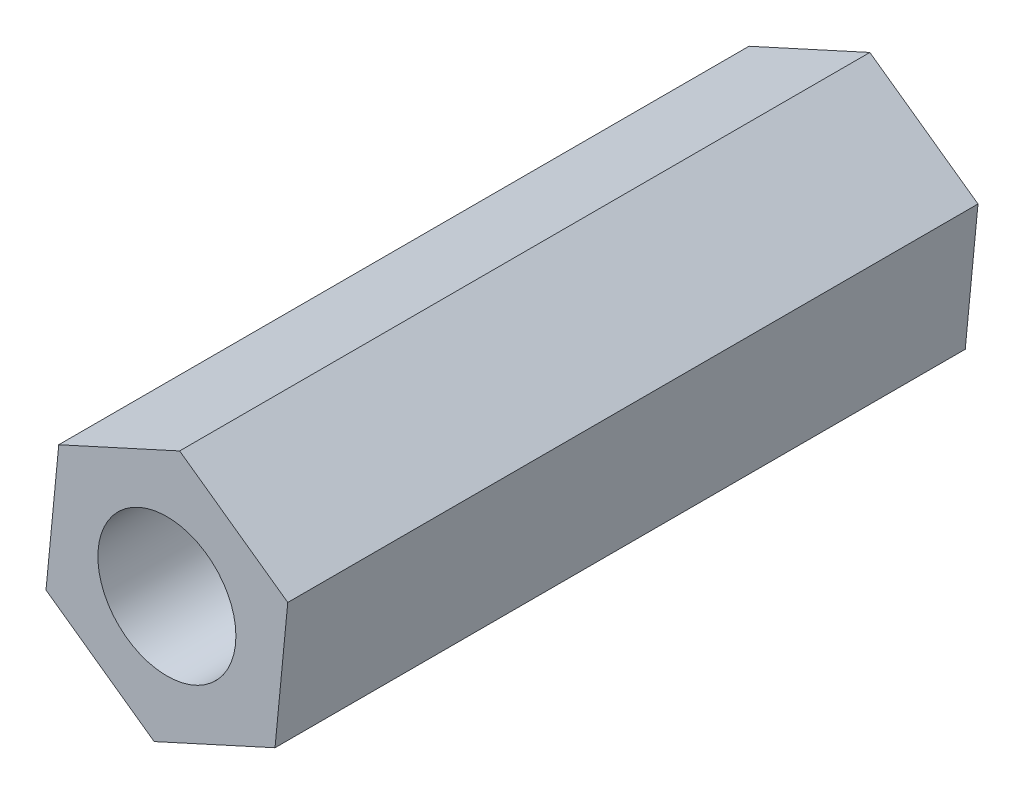
ISO-10303-21;
HEADER;
FILE_DESCRIPTION(('STEP AP214'),'2;1');
FILE_NAME('part.step','',(''),(''),'','','');
FILE_SCHEMA(('AUTOMOTIVE_DESIGN { 1 0 10303 214 1 1 1 1 }'));
ENDSEC;
DATA;
#1=APPLICATION_CONTEXT('core data for automotive mechanical design processes');
#2=APPLICATION_PROTOCOL_DEFINITION('international standard','automotive_design',2000,#1);
#3=PRODUCT_CONTEXT('',#1,'mechanical');
#4=PRODUCT('Part','Part','',(#3));
#5=PRODUCT_RELATED_PRODUCT_CATEGORY('part','',(#4));
#6=PRODUCT_DEFINITION_FORMATION('','',#4);
#7=PRODUCT_DEFINITION_CONTEXT('part definition',#1,'design');
#8=PRODUCT_DEFINITION('design','',#6,#7);
#9=PRODUCT_DEFINITION_SHAPE('','',#8);
#10=(LENGTH_UNIT() NAMED_UNIT(*) SI_UNIT(.MILLI.,.METRE.));
#11=(NAMED_UNIT(*) PLANE_ANGLE_UNIT() SI_UNIT($,.RADIAN.));
#12=(NAMED_UNIT(*) SI_UNIT($,.STERADIAN.) SOLID_ANGLE_UNIT());
#13=UNCERTAINTY_MEASURE_WITH_UNIT(LENGTH_MEASURE(1.E-05),#10,'distance_accuracy_value','');
#14=(GEOMETRIC_REPRESENTATION_CONTEXT(3) GLOBAL_UNCERTAINTY_ASSIGNED_CONTEXT((#13)) GLOBAL_UNIT_ASSIGNED_CONTEXT((#10,
#11,#12)) REPRESENTATION_CONTEXT('',''));
#15=CARTESIAN_POINT('',(0.,0.,0.));
#16=DIRECTION('',(0.,0.,1.));
#17=DIRECTION('',(1.,0.,0.));
#18=AXIS2_PLACEMENT_3D('',#15,#16,#17);
#19=CARTESIAN_POINT('',(0.,0.,15.));
#20=DIRECTION('',(0.,0.,1.));
#21=DIRECTION('',(1.,0.,0.));
#22=AXIS2_PLACEMENT_3D('',#19,#20,#21);
#23=PLANE('',#22);
#24=DIRECTION('',(0.0959864545210911,0.995382640268792,0.));
#25=VECTOR('',#24,1.);
#26=CARTESIAN_POINT('',(2.34991208728121,-1.6766772245674,15.));
#27=LINE('',#26,#25);
#28=CARTESIAN_POINT('',(2.34991208728121,-1.6766772245674,15.));
#29=VERTEX_POINT('',#28);
#30=CARTESIAN_POINT('',(2.62700111406275,1.19674495196194,15.));
#31=VERTEX_POINT('',#30);
#32=EDGE_CURVE('E128',#29,#31,#27,.T.);
#33=ORIENTED_EDGE('',*,*,#32,.T.);
#34=DIRECTION('',(-0.814033425698255,0.58081802816886,0.));
#35=VECTOR('',#34,1.);
#36=CARTESIAN_POINT('',(2.62700111406275,1.19674495196194,15.));
#37=LINE('',#36,#35);
#38=CARTESIAN_POINT('',(0.277089026781549,2.87342217652934,15.));
#39=VERTEX_POINT('',#38);
#40=EDGE_CURVE('E86',#31,#39,#37,.T.);
#41=ORIENTED_EDGE('',*,*,#40,.T.);
#42=DIRECTION('',(-0.910019880219347,-0.414564612099931,0.));
#43=VECTOR('',#42,1.);
#44=CARTESIAN_POINT('',(0.277089026781549,2.87342217652934,15.));
#45=LINE('',#44,#43);
#46=CARTESIAN_POINT('',(-2.3499120872812,1.6766772245674,15.));
#47=VERTEX_POINT('',#46);
#48=EDGE_CURVE('E99',#39,#47,#45,.T.);
#49=ORIENTED_EDGE('',*,*,#48,.T.);
#50=DIRECTION('',(-0.0959864545210913,-0.995382640268792,0.));
#51=VECTOR('',#50,1.);
#52=CARTESIAN_POINT('',(-2.3499120872812,1.6766772245674,15.));
#53=LINE('',#52,#51);
#54=CARTESIAN_POINT('',(-2.62700111406275,-1.19674495196194,15.));
#55=VERTEX_POINT('',#54);
#56=EDGE_CURVE('E93',#47,#55,#53,.T.);
#57=ORIENTED_EDGE('',*,*,#56,.T.);
#58=DIRECTION('',(0.814033425698255,-0.580818028168861,0.));
#59=VECTOR('',#58,1.);
#60=CARTESIAN_POINT('',(-2.62700111406275,-1.19674495196194,15.));
#61=LINE('',#60,#59);
#62=CARTESIAN_POINT('',(-0.277089026781548,-2.87342217652934,15.));
#63=VERTEX_POINT('',#62);
#64=EDGE_CURVE('E97',#55,#63,#61,.T.);
#65=ORIENTED_EDGE('',*,*,#64,.T.);
#66=DIRECTION('',(0.910019880219347,0.414564612099931,0.));
#67=VECTOR('',#66,1.);
#68=CARTESIAN_POINT('',(-0.277089026781548,-2.87342217652934,15.));
#69=LINE('',#68,#67);
#70=EDGE_CURVE('E49',#63,#29,#69,.T.);
#71=ORIENTED_EDGE('',*,*,#70,.T.);
#72=EDGE_LOOP('',(#33,#41,#49,#57,#65,#71));
#73=FACE_BOUND('',#72,.T.);
#74=CARTESIAN_POINT('',(0.,0.,15.));
#75=DIRECTION('',(0.,0.,1.));
#76=DIRECTION('',(1.,0.,0.));
#77=AXIS2_PLACEMENT_3D('',#74,#75,#76);
#78=CIRCLE('',#77,1.5);
#79=CARTESIAN_POINT('',(1.5,0.,15.));
#80=VERTEX_POINT('',#79);
#81=EDGE_CURVE('E121',#80,#80,#78,.T.);
#82=ORIENTED_EDGE('',*,*,#81,.F.);
#83=EDGE_LOOP('',(#82));
#84=FACE_BOUND('',#83,.T.);
#85=ADVANCED_FACE('F32',(#73,#84),#23,.T.);
#86=CARTESIAN_POINT('',(0.,0.,0.));
#87=DIRECTION('',(0.,0.,1.));
#88=DIRECTION('',(1.,0.,0.));
#89=AXIS2_PLACEMENT_3D('',#86,#87,#88);
#90=PLANE('',#89);
#91=DIRECTION('',(0.0959864545210911,0.995382640268792,0.));
#92=VECTOR('',#91,1.);
#93=CARTESIAN_POINT('',(2.34991208728121,-1.6766772245674,0.));
#94=LINE('',#93,#92);
#95=CARTESIAN_POINT('',(2.34991208728121,-1.6766772245674,0.));
#96=VERTEX_POINT('',#95);
#97=CARTESIAN_POINT('',(2.62700111406275,1.19674495196194,0.));
#98=VERTEX_POINT('',#97);
#99=EDGE_CURVE('E117',#96,#98,#94,.T.);
#100=ORIENTED_EDGE('',*,*,#99,.F.);
#101=DIRECTION('',(0.910019880219347,0.414564612099931,0.));
#102=VECTOR('',#101,1.);
#103=CARTESIAN_POINT('',(-0.277089026781548,-2.87342217652934,0.));
#104=LINE('',#103,#102);
#105=CARTESIAN_POINT('',(-0.277089026781548,-2.87342217652934,0.));
#106=VERTEX_POINT('',#105);
#107=EDGE_CURVE('E78',#106,#96,#104,.T.);
#108=ORIENTED_EDGE('',*,*,#107,.F.);
#109=DIRECTION('',(0.814033425698255,-0.580818028168861,0.));
#110=VECTOR('',#109,1.);
#111=CARTESIAN_POINT('',(-2.62700111406275,-1.19674495196194,0.));
#112=LINE('',#111,#110);
#113=CARTESIAN_POINT('',(-2.62700111406275,-1.19674495196194,0.));
#114=VERTEX_POINT('',#113);
#115=EDGE_CURVE('E72',#114,#106,#112,.T.);
#116=ORIENTED_EDGE('',*,*,#115,.F.);
#117=DIRECTION('',(-0.0959864545210913,-0.995382640268792,0.));
#118=VECTOR('',#117,1.);
#119=CARTESIAN_POINT('',(-2.3499120872812,1.6766772245674,0.));
#120=LINE('',#119,#118);
#121=CARTESIAN_POINT('',(-2.3499120872812,1.6766772245674,0.));
#122=VERTEX_POINT('',#121);
#123=EDGE_CURVE('E107',#122,#114,#120,.T.);
#124=ORIENTED_EDGE('',*,*,#123,.F.);
#125=DIRECTION('',(-0.910019880219347,-0.414564612099931,0.));
#126=VECTOR('',#125,1.);
#127=CARTESIAN_POINT('',(0.277089026781549,2.87342217652934,0.));
#128=LINE('',#127,#126);
#129=CARTESIAN_POINT('',(0.277089026781549,2.87342217652934,0.));
#130=VERTEX_POINT('',#129);
#131=EDGE_CURVE('E123',#130,#122,#128,.T.);
#132=ORIENTED_EDGE('',*,*,#131,.F.);
#133=DIRECTION('',(-0.814033425698255,0.58081802816886,0.));
#134=VECTOR('',#133,1.);
#135=CARTESIAN_POINT('',(2.62700111406275,1.19674495196194,0.));
#136=LINE('',#135,#134);
#137=EDGE_CURVE('E120',#98,#130,#136,.T.);
#138=ORIENTED_EDGE('',*,*,#137,.F.);
#139=EDGE_LOOP('',(#100,#108,#116,#124,#132,#138));
#140=FACE_BOUND('',#139,.T.);
#141=CARTESIAN_POINT('',(0.,0.,0.));
#142=DIRECTION('',(0.,0.,1.));
#143=DIRECTION('',(1.,0.,0.));
#144=AXIS2_PLACEMENT_3D('',#141,#142,#143);
#145=CIRCLE('',#144,1.5);
#146=CARTESIAN_POINT('',(1.5,0.,0.));
#147=VERTEX_POINT('',#146);
#148=EDGE_CURVE('E221',#147,#147,#145,.T.);
#149=ORIENTED_EDGE('',*,*,#148,.T.);
#150=EDGE_LOOP('',(#149));
#151=FACE_BOUND('',#150,.T.);
#152=ADVANCED_FACE('F137',(#140,#151),#90,.F.);
#153=CARTESIAN_POINT('',(2.34991208728121,-1.6766772245674,15.));
#154=DIRECTION('',(-0.995382640268792,0.0959864545210911,0.));
#155=DIRECTION('',(-0.0959864545210911,-0.995382640268792,0.));
#156=AXIS2_PLACEMENT_3D('',#153,#154,#155);
#157=PLANE('',#156);
#158=ORIENTED_EDGE('',*,*,#99,.T.);
#159=DIRECTION('',(0.,0.,-1.));
#160=VECTOR('',#159,1.);
#161=CARTESIAN_POINT('',(2.62700111406275,1.19674495196194,15.));
#162=LINE('',#161,#160);
#163=EDGE_CURVE('E11',#31,#98,#162,.T.);
#164=ORIENTED_EDGE('',*,*,#163,.F.);
#165=ORIENTED_EDGE('',*,*,#32,.F.);
#166=DIRECTION('',(0.,0.,-1.));
#167=VECTOR('',#166,1.);
#168=CARTESIAN_POINT('',(2.34991208728121,-1.6766772245674,15.));
#169=LINE('',#168,#167);
#170=EDGE_CURVE('E113',#29,#96,#169,.T.);
#171=ORIENTED_EDGE('',*,*,#170,.T.);
#172=EDGE_LOOP('',(#158,#164,#165,#171));
#173=FACE_BOUND('',#172,.T.);
#174=ADVANCED_FACE('F34',(#173),#157,.F.);
#175=CARTESIAN_POINT('',(2.62700111406275,1.19674495196194,15.));
#176=DIRECTION('',(-0.58081802816886,-0.814033425698255,0.));
#177=DIRECTION('',(0.814033425698255,-0.58081802816886,0.));
#178=AXIS2_PLACEMENT_3D('',#175,#176,#177);
#179=PLANE('',#178);
#180=ORIENTED_EDGE('',*,*,#137,.T.);
#181=DIRECTION('',(0.,0.,-1.));
#182=VECTOR('',#181,1.);
#183=CARTESIAN_POINT('',(0.277089026781549,2.87342217652934,15.));
#184=LINE('',#183,#182);
#185=EDGE_CURVE('E41',#39,#130,#184,.T.);
#186=ORIENTED_EDGE('',*,*,#185,.F.);
#187=ORIENTED_EDGE('',*,*,#40,.F.);
#188=ORIENTED_EDGE('',*,*,#163,.T.);
#189=EDGE_LOOP('',(#180,#186,#187,#188));
#190=FACE_BOUND('',#189,.T.);
#191=ADVANCED_FACE('F162',(#190),#179,.F.);
#192=CARTESIAN_POINT('',(0.277089026781549,2.87342217652934,15.));
#193=DIRECTION('',(0.414564612099931,-0.910019880219347,0.));
#194=DIRECTION('',(0.910019880219347,0.414564612099931,0.));
#195=AXIS2_PLACEMENT_3D('',#192,#193,#194);
#196=PLANE('',#195);
#197=ORIENTED_EDGE('',*,*,#131,.T.);
#198=DIRECTION('',(0.,0.,-1.));
#199=VECTOR('',#198,1.);
#200=CARTESIAN_POINT('',(-2.3499120872812,1.6766772245674,15.));
#201=LINE('',#200,#199);
#202=EDGE_CURVE('E108',#47,#122,#201,.T.);
#203=ORIENTED_EDGE('',*,*,#202,.F.);
#204=ORIENTED_EDGE('',*,*,#48,.F.);
#205=ORIENTED_EDGE('',*,*,#185,.T.);
#206=EDGE_LOOP('',(#197,#203,#204,#205));
#207=FACE_BOUND('',#206,.T.);
#208=ADVANCED_FACE('F134',(#207),#196,.F.);
#209=CARTESIAN_POINT('',(-2.3499120872812,1.6766772245674,15.));
#210=DIRECTION('',(0.995382640268792,-0.0959864545210913,0.));
#211=DIRECTION('',(0.0959864545210913,0.995382640268792,0.));
#212=AXIS2_PLACEMENT_3D('',#209,#210,#211);
#213=PLANE('',#212);
#214=ORIENTED_EDGE('',*,*,#123,.T.);
#215=DIRECTION('',(0.,0.,-1.));
#216=VECTOR('',#215,1.);
#217=CARTESIAN_POINT('',(-2.62700111406275,-1.19674495196194,15.));
#218=LINE('',#217,#216);
#219=EDGE_CURVE('E104',#55,#114,#218,.T.);
#220=ORIENTED_EDGE('',*,*,#219,.F.);
#221=ORIENTED_EDGE('',*,*,#56,.F.);
#222=ORIENTED_EDGE('',*,*,#202,.T.);
#223=EDGE_LOOP('',(#214,#220,#221,#222));
#224=FACE_BOUND('',#223,.T.);
#225=ADVANCED_FACE('F105',(#224),#213,.F.);
#226=CARTESIAN_POINT('',(-2.62700111406275,-1.19674495196194,15.));
#227=DIRECTION('',(0.580818028168861,0.814033425698255,0.));
#228=DIRECTION('',(-0.814033425698255,0.580818028168861,0.));
#229=AXIS2_PLACEMENT_3D('',#226,#227,#228);
#230=PLANE('',#229);
#231=ORIENTED_EDGE('',*,*,#115,.T.);
#232=DIRECTION('',(0.,0.,-1.));
#233=VECTOR('',#232,1.);
#234=CARTESIAN_POINT('',(-0.277089026781548,-2.87342217652934,15.));
#235=LINE('',#234,#233);
#236=EDGE_CURVE('E109',#63,#106,#235,.T.);
#237=ORIENTED_EDGE('',*,*,#236,.F.);
#238=ORIENTED_EDGE('',*,*,#64,.F.);
#239=ORIENTED_EDGE('',*,*,#219,.T.);
#240=EDGE_LOOP('',(#231,#237,#238,#239));
#241=FACE_BOUND('',#240,.T.);
#242=ADVANCED_FACE('F111',(#241),#230,.F.);
#243=CARTESIAN_POINT('',(-0.277089026781548,-2.87342217652934,15.));
#244=DIRECTION('',(-0.414564612099931,0.910019880219347,0.));
#245=DIRECTION('',(-0.910019880219347,-0.414564612099931,0.));
#246=AXIS2_PLACEMENT_3D('',#243,#244,#245);
#247=PLANE('',#246);
#248=ORIENTED_EDGE('',*,*,#107,.T.);
#249=ORIENTED_EDGE('',*,*,#170,.F.);
#250=ORIENTED_EDGE('',*,*,#70,.F.);
#251=ORIENTED_EDGE('',*,*,#236,.T.);
#252=EDGE_LOOP('',(#248,#249,#250,#251));
#253=FACE_BOUND('',#252,.T.);
#254=ADVANCED_FACE('F142',(#253),#247,.F.);
#255=CARTESIAN_POINT('',(0.,0.,15.));
#256=DIRECTION('',(0.,0.,-1.));
#257=DIRECTION('',(-1.,0.,0.));
#258=AXIS2_PLACEMENT_3D('',#255,#256,#257);
#259=CYLINDRICAL_SURFACE('',#258,1.5);
#260=ORIENTED_EDGE('',*,*,#81,.T.);
#261=EDGE_LOOP('',(#260));
#262=FACE_BOUND('',#261,.T.);
#263=ORIENTED_EDGE('',*,*,#148,.F.);
#264=EDGE_LOOP('',(#263));
#265=FACE_BOUND('',#264,.T.);
#266=ADVANCED_FACE('F144',(#262,#265),#259,.F.);
#267=CLOSED_SHELL('',(#85,#152,#174,#191,#208,#225,#242,#254,#266));
#268=MANIFOLD_SOLID_BREP('B2',#267);
#269=ADVANCED_BREP_SHAPE_REPRESENTATION('',(#18,#268),#14);
#270=SHAPE_DEFINITION_REPRESENTATION(#9,#269);
ENDSEC;
END-ISO-10303-21;
